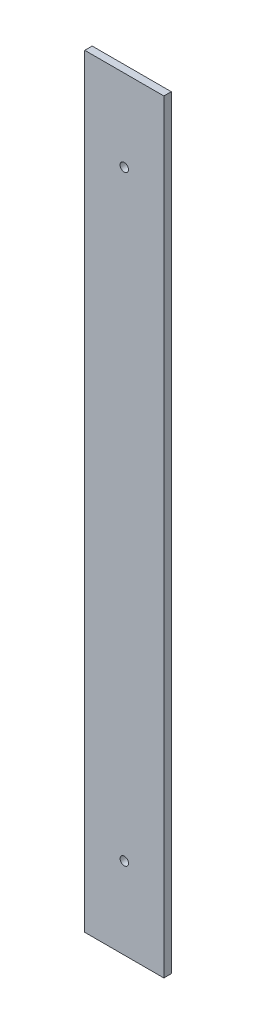
ISO-10303-21;
HEADER;
FILE_DESCRIPTION(('STEP AP214'),'2;1');
FILE_NAME('part.step','',(''),(''),'','','');
FILE_SCHEMA(('AUTOMOTIVE_DESIGN { 1 0 10303 214 1 1 1 1 }'));
ENDSEC;
DATA;
#1=APPLICATION_CONTEXT('core data for automotive mechanical design processes');
#2=APPLICATION_PROTOCOL_DEFINITION('international standard','automotive_design',2000,#1);
#3=PRODUCT_CONTEXT('',#1,'mechanical');
#4=PRODUCT('Part','Part','',(#3));
#5=PRODUCT_RELATED_PRODUCT_CATEGORY('part','',(#4));
#6=PRODUCT_DEFINITION_FORMATION('','',#4);
#7=PRODUCT_DEFINITION_CONTEXT('part definition',#1,'design');
#8=PRODUCT_DEFINITION('design','',#6,#7);
#9=PRODUCT_DEFINITION_SHAPE('','',#8);
#10=(LENGTH_UNIT() NAMED_UNIT(*) SI_UNIT(.MILLI.,.METRE.));
#11=(NAMED_UNIT(*) PLANE_ANGLE_UNIT() SI_UNIT($,.RADIAN.));
#12=(NAMED_UNIT(*) SI_UNIT($,.STERADIAN.) SOLID_ANGLE_UNIT());
#13=UNCERTAINTY_MEASURE_WITH_UNIT(LENGTH_MEASURE(1.E-05),#10,'distance_accuracy_value','');
#14=(GEOMETRIC_REPRESENTATION_CONTEXT(3) GLOBAL_UNCERTAINTY_ASSIGNED_CONTEXT((#13)) GLOBAL_UNIT_ASSIGNED_CONTEXT((#10,
#11,#12)) REPRESENTATION_CONTEXT('',''));
#15=CARTESIAN_POINT('',(0.,0.,0.));
#16=DIRECTION('',(0.,0.,1.));
#17=DIRECTION('',(1.,0.,0.));
#18=AXIS2_PLACEMENT_3D('',#15,#16,#17);
#19=CARTESIAN_POINT('',(-16.,154.5,3.));
#20=DIRECTION('',(1.,0.,0.));
#21=DIRECTION('',(0.,1.,0.));
#22=AXIS2_PLACEMENT_3D('',#19,#20,#21);
#23=PLANE('',#22);
#24=DIRECTION('',(0.,-1.,0.));
#25=VECTOR('',#24,1.);
#26=CARTESIAN_POINT('',(-16.,154.5,0.));
#27=LINE('',#26,#25);
#28=CARTESIAN_POINT('',(-16.,154.5,0.));
#29=VERTEX_POINT('',#28);
#30=CARTESIAN_POINT('',(-16.,-154.5,0.));
#31=VERTEX_POINT('',#30);
#32=EDGE_CURVE('E102',#29,#31,#27,.T.);
#33=ORIENTED_EDGE('',*,*,#32,.T.);
#34=DIRECTION('',(0.,0.,-1.));
#35=VECTOR('',#34,1.);
#36=CARTESIAN_POINT('',(-16.,-154.5,3.));
#37=LINE('',#36,#35);
#38=CARTESIAN_POINT('',(-16.,-154.5,3.));
#39=VERTEX_POINT('',#38);
#40=EDGE_CURVE('E11',#39,#31,#37,.T.);
#41=ORIENTED_EDGE('',*,*,#40,.F.);
#42=DIRECTION('',(0.,-1.,0.));
#43=VECTOR('',#42,1.);
#44=CARTESIAN_POINT('',(-16.,154.5,3.));
#45=LINE('',#44,#43);
#46=CARTESIAN_POINT('',(-16.,154.5,3.));
#47=VERTEX_POINT('',#46);
#48=EDGE_CURVE('E90',#47,#39,#45,.T.);
#49=ORIENTED_EDGE('',*,*,#48,.F.);
#50=DIRECTION('',(0.,0.,-1.));
#51=VECTOR('',#50,1.);
#52=CARTESIAN_POINT('',(-16.,154.5,3.));
#53=LINE('',#52,#51);
#54=EDGE_CURVE('E98',#47,#29,#53,.T.);
#55=ORIENTED_EDGE('',*,*,#54,.T.);
#56=EDGE_LOOP('',(#33,#41,#49,#55));
#57=FACE_BOUND('',#56,.T.);
#58=ADVANCED_FACE('F39',(#57),#23,.F.);
#59=CARTESIAN_POINT('',(16.,-154.5,3.));
#60=DIRECTION('',(0.,1.,0.));
#61=DIRECTION('',(0.,0.,1.));
#62=AXIS2_PLACEMENT_3D('',#59,#60,#61);
#63=PLANE('',#62);
#64=DIRECTION('',(1.,0.,0.));
#65=VECTOR('',#64,1.);
#66=CARTESIAN_POINT('',(16.,-154.5,0.));
#67=LINE('',#66,#65);
#68=CARTESIAN_POINT('',(16.,-154.5,0.));
#69=VERTEX_POINT('',#68);
#70=EDGE_CURVE('E94',#31,#69,#67,.T.);
#71=ORIENTED_EDGE('',*,*,#70,.T.);
#72=DIRECTION('',(0.,0.,-1.));
#73=VECTOR('',#72,1.);
#74=CARTESIAN_POINT('',(16.,-154.5,3.));
#75=LINE('',#74,#73);
#76=CARTESIAN_POINT('',(16.,-154.5,3.));
#77=VERTEX_POINT('',#76);
#78=EDGE_CURVE('E47',#77,#69,#75,.T.);
#79=ORIENTED_EDGE('',*,*,#78,.F.);
#80=DIRECTION('',(1.,0.,0.));
#81=VECTOR('',#80,1.);
#82=CARTESIAN_POINT('',(16.,-154.5,3.));
#83=LINE('',#82,#81);
#84=EDGE_CURVE('E85',#39,#77,#83,.T.);
#85=ORIENTED_EDGE('',*,*,#84,.F.);
#86=ORIENTED_EDGE('',*,*,#40,.T.);
#87=EDGE_LOOP('',(#71,#79,#85,#86));
#88=FACE_BOUND('',#87,.T.);
#89=ADVANCED_FACE('F93',(#88),#63,.F.);
#90=CARTESIAN_POINT('',(16.,154.5,3.));
#91=DIRECTION('',(-1.,0.,0.));
#92=DIRECTION('',(0.,-1.,0.));
#93=AXIS2_PLACEMENT_3D('',#90,#91,#92);
#94=PLANE('',#93);
#95=DIRECTION('',(0.,1.,0.));
#96=VECTOR('',#95,1.);
#97=CARTESIAN_POINT('',(16.,154.5,0.));
#98=LINE('',#97,#96);
#99=CARTESIAN_POINT('',(16.,154.5,0.));
#100=VERTEX_POINT('',#99);
#101=EDGE_CURVE('E72',#69,#100,#98,.T.);
#102=ORIENTED_EDGE('',*,*,#101,.T.);
#103=DIRECTION('',(0.,0.,-1.));
#104=VECTOR('',#103,1.);
#105=CARTESIAN_POINT('',(16.,154.5,3.));
#106=LINE('',#105,#104);
#107=CARTESIAN_POINT('',(16.,154.5,3.));
#108=VERTEX_POINT('',#107);
#109=EDGE_CURVE('E95',#108,#100,#106,.T.);
#110=ORIENTED_EDGE('',*,*,#109,.F.);
#111=DIRECTION('',(0.,1.,0.));
#112=VECTOR('',#111,1.);
#113=CARTESIAN_POINT('',(16.,154.5,3.));
#114=LINE('',#113,#112);
#115=EDGE_CURVE('E88',#77,#108,#114,.T.);
#116=ORIENTED_EDGE('',*,*,#115,.F.);
#117=ORIENTED_EDGE('',*,*,#78,.T.);
#118=EDGE_LOOP('',(#102,#110,#116,#117));
#119=FACE_BOUND('',#118,.T.);
#120=ADVANCED_FACE('F96',(#119),#94,.F.);
#121=CARTESIAN_POINT('',(16.,154.5,3.));
#122=DIRECTION('',(0.,-1.,0.));
#123=DIRECTION('',(0.,0.,-1.));
#124=AXIS2_PLACEMENT_3D('',#121,#122,#123);
#125=PLANE('',#124);
#126=DIRECTION('',(-1.,0.,0.));
#127=VECTOR('',#126,1.);
#128=CARTESIAN_POINT('',(16.,154.5,0.));
#129=LINE('',#128,#127);
#130=EDGE_CURVE('E78',#100,#29,#129,.T.);
#131=ORIENTED_EDGE('',*,*,#130,.T.);
#132=ORIENTED_EDGE('',*,*,#54,.F.);
#133=DIRECTION('',(-1.,0.,0.));
#134=VECTOR('',#133,1.);
#135=CARTESIAN_POINT('',(16.,154.5,3.));
#136=LINE('',#135,#134);
#137=EDGE_CURVE('E55',#108,#47,#136,.T.);
#138=ORIENTED_EDGE('',*,*,#137,.F.);
#139=ORIENTED_EDGE('',*,*,#109,.T.);
#140=EDGE_LOOP('',(#131,#132,#138,#139));
#141=FACE_BOUND('',#140,.T.);
#142=ADVANCED_FACE('F110',(#141),#125,.F.);
#143=CARTESIAN_POINT('',(0.,0.,3.));
#144=DIRECTION('',(0.,0.,-1.));
#145=DIRECTION('',(-1.,0.,0.));
#146=AXIS2_PLACEMENT_3D('',#143,#144,#145);
#147=PLANE('',#146);
#148=CARTESIAN_POINT('',(0.,121.5,3.));
#149=DIRECTION('',(0.,0.,1.));
#150=DIRECTION('',(1.,0.,0.));
#151=AXIS2_PLACEMENT_3D('',#148,#149,#150);
#152=CIRCLE('',#151,1.7);
#153=CARTESIAN_POINT('',(1.69999999999999,121.5,3.));
#154=VERTEX_POINT('',#153);
#155=EDGE_CURVE('E122',#154,#154,#152,.T.);
#156=ORIENTED_EDGE('',*,*,#155,.F.);
#157=EDGE_LOOP('',(#156));
#158=FACE_BOUND('',#157,.T.);
#159=CARTESIAN_POINT('',(0.,-121.5,3.));
#160=DIRECTION('',(0.,0.,1.));
#161=DIRECTION('',(-1.,0.,0.));
#162=AXIS2_PLACEMENT_3D('',#159,#160,#161);
#163=CIRCLE('',#162,1.7);
#164=CARTESIAN_POINT('',(-1.70000000000001,-121.5,3.));
#165=VERTEX_POINT('',#164);
#166=EDGE_CURVE('E119',#165,#165,#163,.T.);
#167=ORIENTED_EDGE('',*,*,#166,.F.);
#168=EDGE_LOOP('',(#167));
#169=FACE_BOUND('',#168,.T.);
#170=ORIENTED_EDGE('',*,*,#48,.T.);
#171=ORIENTED_EDGE('',*,*,#84,.T.);
#172=ORIENTED_EDGE('',*,*,#115,.T.);
#173=ORIENTED_EDGE('',*,*,#137,.T.);
#174=EDGE_LOOP('',(#170,#171,#172,#173));
#175=FACE_BOUND('',#174,.T.);
#176=ADVANCED_FACE('F86',(#158,#169,#175),#147,.F.);
#177=CARTESIAN_POINT('',(0.,0.,0.));
#178=DIRECTION('',(0.,0.,-1.));
#179=DIRECTION('',(-1.,0.,0.));
#180=AXIS2_PLACEMENT_3D('',#177,#178,#179);
#181=PLANE('',#180);
#182=CARTESIAN_POINT('',(0.,121.5,0.));
#183=DIRECTION('',(0.,0.,1.));
#184=DIRECTION('',(1.,0.,0.));
#185=AXIS2_PLACEMENT_3D('',#182,#183,#184);
#186=CIRCLE('',#185,1.7);
#187=CARTESIAN_POINT('',(1.69999999999999,121.5,0.));
#188=VERTEX_POINT('',#187);
#189=EDGE_CURVE('E105',#188,#188,#186,.T.);
#190=ORIENTED_EDGE('',*,*,#189,.T.);
#191=EDGE_LOOP('',(#190));
#192=FACE_BOUND('',#191,.T.);
#193=CARTESIAN_POINT('',(0.,-121.5,0.));
#194=DIRECTION('',(0.,0.,1.));
#195=DIRECTION('',(-1.,0.,0.));
#196=AXIS2_PLACEMENT_3D('',#193,#194,#195);
#197=CIRCLE('',#196,1.7);
#198=CARTESIAN_POINT('',(-1.70000000000001,-121.5,0.));
#199=VERTEX_POINT('',#198);
#200=EDGE_CURVE('E116',#199,#199,#197,.T.);
#201=ORIENTED_EDGE('',*,*,#200,.T.);
#202=EDGE_LOOP('',(#201));
#203=FACE_BOUND('',#202,.T.);
#204=ORIENTED_EDGE('',*,*,#32,.F.);
#205=ORIENTED_EDGE('',*,*,#130,.F.);
#206=ORIENTED_EDGE('',*,*,#101,.F.);
#207=ORIENTED_EDGE('',*,*,#70,.F.);
#208=EDGE_LOOP('',(#204,#205,#206,#207));
#209=FACE_BOUND('',#208,.T.);
#210=ADVANCED_FACE('F113',(#192,#203,#209),#181,.T.);
#211=CARTESIAN_POINT('',(0.,-121.5,0.));
#212=DIRECTION('',(0.,0.,1.));
#213=DIRECTION('',(1.,0.,0.));
#214=AXIS2_PLACEMENT_3D('',#211,#212,#213);
#215=CYLINDRICAL_SURFACE('',#214,1.7);
#216=ORIENTED_EDGE('',*,*,#200,.F.);
#217=EDGE_LOOP('',(#216));
#218=FACE_BOUND('',#217,.T.);
#219=ORIENTED_EDGE('',*,*,#166,.T.);
#220=EDGE_LOOP('',(#219));
#221=FACE_BOUND('',#220,.T.);
#222=ADVANCED_FACE('F133',(#218,#221),#215,.F.);
#223=CARTESIAN_POINT('',(0.,121.5,0.));
#224=DIRECTION('',(0.,0.,1.));
#225=DIRECTION('',(1.,0.,0.));
#226=AXIS2_PLACEMENT_3D('',#223,#224,#225);
#227=CYLINDRICAL_SURFACE('',#226,1.7);
#228=ORIENTED_EDGE('',*,*,#189,.F.);
#229=EDGE_LOOP('',(#228));
#230=FACE_BOUND('',#229,.T.);
#231=ORIENTED_EDGE('',*,*,#155,.T.);
#232=EDGE_LOOP('',(#231));
#233=FACE_BOUND('',#232,.T.);
#234=ADVANCED_FACE('F130',(#230,#233),#227,.F.);
#235=CLOSED_SHELL('',(#58,#89,#120,#142,#176,#210,#222,#234));
#236=MANIFOLD_SOLID_BREP('B2',#235);
#237=ADVANCED_BREP_SHAPE_REPRESENTATION('',(#18,#236),#14);
#238=SHAPE_DEFINITION_REPRESENTATION(#9,#237);
ENDSEC;
END-ISO-10303-21;
